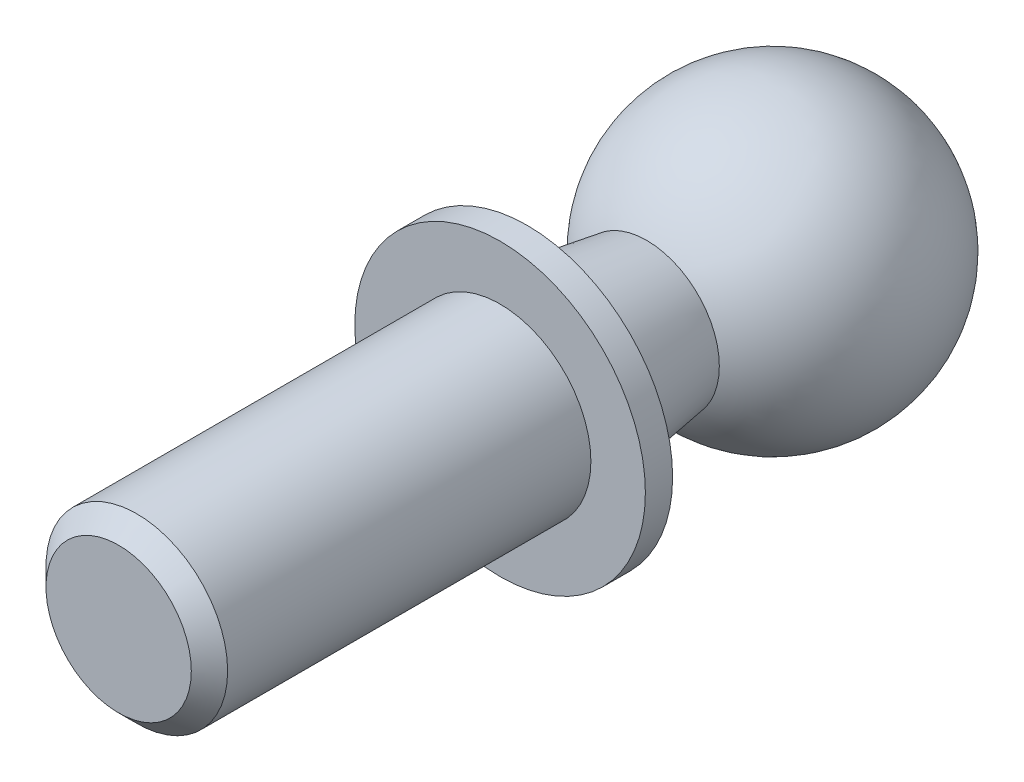
ISO-10303-21;
HEADER;
FILE_DESCRIPTION(('STEP AP214'),'2;1');
FILE_NAME('part.step','',(''),(''),'','','');
FILE_SCHEMA(('AUTOMOTIVE_DESIGN { 1 0 10303 214 1 1 1 1 }'));
ENDSEC;
DATA;
#1=APPLICATION_CONTEXT('core data for automotive mechanical design processes');
#2=APPLICATION_PROTOCOL_DEFINITION('international standard','automotive_design',2000,#1);
#3=PRODUCT_CONTEXT('',#1,'mechanical');
#4=PRODUCT('Part','Part','',(#3));
#5=PRODUCT_RELATED_PRODUCT_CATEGORY('part','',(#4));
#6=PRODUCT_DEFINITION_FORMATION('','',#4);
#7=PRODUCT_DEFINITION_CONTEXT('part definition',#1,'design');
#8=PRODUCT_DEFINITION('design','',#6,#7);
#9=PRODUCT_DEFINITION_SHAPE('','',#8);
#10=(LENGTH_UNIT() NAMED_UNIT(*) SI_UNIT(.MILLI.,.METRE.));
#11=(NAMED_UNIT(*) PLANE_ANGLE_UNIT() SI_UNIT($,.RADIAN.));
#12=(NAMED_UNIT(*) SI_UNIT($,.STERADIAN.) SOLID_ANGLE_UNIT());
#13=UNCERTAINTY_MEASURE_WITH_UNIT(LENGTH_MEASURE(1.E-05),#10,'distance_accuracy_value','');
#14=(GEOMETRIC_REPRESENTATION_CONTEXT(3) GLOBAL_UNCERTAINTY_ASSIGNED_CONTEXT((#13)) GLOBAL_UNIT_ASSIGNED_CONTEXT((#10,
#11,#12)) REPRESENTATION_CONTEXT('',''));
#15=CARTESIAN_POINT('',(0.,0.,0.));
#16=DIRECTION('',(0.,0.,1.));
#17=DIRECTION('',(1.,0.,0.));
#18=AXIS2_PLACEMENT_3D('',#15,#16,#17);
#19=CARTESIAN_POINT('',(0.,0.,0.));
#20=DIRECTION('',(0.,0.,1.));
#21=DIRECTION('',(0.,1.,0.));
#22=AXIS2_PLACEMENT_3D('',#19,#20,#21);
#23=SPHERICAL_SURFACE('',#22,8.);
#24=CARTESIAN_POINT('',(0.,0.,6.92820323027551));
#25=DIRECTION('',(0.,0.,1.));
#26=DIRECTION('',(1.,0.,0.));
#27=AXIS2_PLACEMENT_3D('',#24,#25,#26);
#28=CIRCLE('',#27,4.);
#29=CARTESIAN_POINT('',(4.,0.,6.92820323027551));
#30=VERTEX_POINT('',#29);
#31=EDGE_CURVE('E50',#30,#30,#28,.T.);
#32=ORIENTED_EDGE('',*,*,#31,.F.);
#33=EDGE_LOOP('',(#32));
#34=FACE_BOUND('',#33,.T.);
#35=ADVANCED_FACE('F38',(#34),#23,.T.);
#36=CARTESIAN_POINT('',(0.,0.,13.5));
#37=DIRECTION('',(0.,0.,1.));
#38=DIRECTION('',(1.,0.,0.));
#39=AXIS2_PLACEMENT_3D('',#36,#37,#38);
#40=CONICAL_SURFACE('',#39,5.,0.151007010021336);
#41=ORIENTED_EDGE('',*,*,#31,.T.);
#42=EDGE_LOOP('',(#41));
#43=FACE_BOUND('',#42,.T.);
#44=CARTESIAN_POINT('',(0.,0.,13.5));
#45=DIRECTION('',(0.,0.,1.));
#46=DIRECTION('',(1.,0.,0.));
#47=AXIS2_PLACEMENT_3D('',#44,#45,#46);
#48=CIRCLE('',#47,5.);
#49=CARTESIAN_POINT('',(5.,0.,13.5));
#50=VERTEX_POINT('',#49);
#51=EDGE_CURVE('E54',#50,#50,#48,.T.);
#52=ORIENTED_EDGE('',*,*,#51,.F.);
#53=EDGE_LOOP('',(#52));
#54=FACE_BOUND('',#53,.T.);
#55=ADVANCED_FACE('F86',(#43,#54),#40,.T.);
#56=CARTESIAN_POINT('',(0.,0.,13.5));
#57=DIRECTION('',(0.,0.,1.));
#58=DIRECTION('',(1.,0.,0.));
#59=AXIS2_PLACEMENT_3D('',#56,#57,#58);
#60=PLANE('',#59);
#61=CARTESIAN_POINT('',(0.,0.,13.5));
#62=DIRECTION('',(0.,0.,1.));
#63=DIRECTION('',(1.,0.,0.));
#64=AXIS2_PLACEMENT_3D('',#61,#62,#63);
#65=CIRCLE('',#64,8.);
#66=CARTESIAN_POINT('',(8.,0.,13.5));
#67=VERTEX_POINT('',#66);
#68=EDGE_CURVE('E59',#67,#67,#65,.T.);
#69=ORIENTED_EDGE('',*,*,#68,.F.);
#70=EDGE_LOOP('',(#69));
#71=FACE_BOUND('',#70,.T.);
#72=ORIENTED_EDGE('',*,*,#51,.T.);
#73=EDGE_LOOP('',(#72));
#74=FACE_BOUND('',#73,.T.);
#75=ADVANCED_FACE('F82',(#71,#74),#60,.F.);
#76=CARTESIAN_POINT('',(0.,0.,-8.));
#77=DIRECTION('',(0.,0.,1.));
#78=DIRECTION('',(1.,0.,0.));
#79=AXIS2_PLACEMENT_3D('',#76,#77,#78);
#80=CYLINDRICAL_SURFACE('',#79,8.);
#81=ORIENTED_EDGE('',*,*,#68,.T.);
#82=EDGE_LOOP('',(#81));
#83=FACE_BOUND('',#82,.T.);
#84=CARTESIAN_POINT('',(0.,0.,15.));
#85=DIRECTION('',(0.,0.,1.));
#86=DIRECTION('',(1.,0.,0.));
#87=AXIS2_PLACEMENT_3D('',#84,#85,#86);
#88=CIRCLE('',#87,8.);
#89=CARTESIAN_POINT('',(8.,0.,15.));
#90=VERTEX_POINT('',#89);
#91=EDGE_CURVE('E62',#90,#90,#88,.T.);
#92=ORIENTED_EDGE('',*,*,#91,.F.);
#93=EDGE_LOOP('',(#92));
#94=FACE_BOUND('',#93,.T.);
#95=ADVANCED_FACE('F73',(#83,#94),#80,.T.);
#96=CARTESIAN_POINT('',(0.,0.,15.));
#97=DIRECTION('',(0.,0.,1.));
#98=DIRECTION('',(1.,0.,0.));
#99=AXIS2_PLACEMENT_3D('',#96,#97,#98);
#100=PLANE('',#99);
#101=ORIENTED_EDGE('',*,*,#91,.T.);
#102=EDGE_LOOP('',(#101));
#103=FACE_BOUND('',#102,.T.);
#104=CARTESIAN_POINT('',(0.,0.,15.));
#105=DIRECTION('',(0.,0.,1.));
#106=DIRECTION('',(1.,0.,0.));
#107=AXIS2_PLACEMENT_3D('',#104,#105,#106);
#108=CIRCLE('',#107,5.);
#109=CARTESIAN_POINT('',(5.,0.,15.));
#110=VERTEX_POINT('',#109);
#111=EDGE_CURVE('E65',#110,#110,#108,.T.);
#112=ORIENTED_EDGE('',*,*,#111,.F.);
#113=EDGE_LOOP('',(#112));
#114=FACE_BOUND('',#113,.T.);
#115=ADVANCED_FACE('F71',(#103,#114),#100,.T.);
#116=CARTESIAN_POINT('',(0.,0.,-8.));
#117=DIRECTION('',(0.,0.,1.));
#118=DIRECTION('',(1.,0.,0.));
#119=AXIS2_PLACEMENT_3D('',#116,#117,#118);
#120=CYLINDRICAL_SURFACE('',#119,5.);
#121=CARTESIAN_POINT('',(0.,0.,35.));
#122=DIRECTION('',(0.,0.,1.));
#123=DIRECTION('',(1.,0.,0.));
#124=AXIS2_PLACEMENT_3D('',#121,#122,#123);
#125=CIRCLE('',#124,5.);
#126=CARTESIAN_POINT('',(5.,0.,35.));
#127=VERTEX_POINT('',#126);
#128=EDGE_CURVE('E10',#127,#127,#125,.F.);
#129=ORIENTED_EDGE('',*,*,#128,.T.);
#130=EDGE_LOOP('',(#129));
#131=FACE_BOUND('',#130,.T.);
#132=ORIENTED_EDGE('',*,*,#111,.T.);
#133=EDGE_LOOP('',(#132));
#134=FACE_BOUND('',#133,.T.);
#135=ADVANCED_FACE('F69',(#131,#134),#120,.T.);
#136=CARTESIAN_POINT('',(0.,0.,36.));
#137=DIRECTION('',(0.,0.,1.));
#138=DIRECTION('',(1.,0.,0.));
#139=AXIS2_PLACEMENT_3D('',#136,#137,#138);
#140=PLANE('',#139);
#141=CARTESIAN_POINT('',(0.,0.,36.));
#142=DIRECTION('',(0.,0.,1.));
#143=DIRECTION('',(1.,0.,0.));
#144=AXIS2_PLACEMENT_3D('',#141,#142,#143);
#145=CIRCLE('',#144,4.);
#146=CARTESIAN_POINT('',(4.,0.,36.));
#147=VERTEX_POINT('',#146);
#148=EDGE_CURVE('E46',#147,#147,#145,.T.);
#149=ORIENTED_EDGE('',*,*,#148,.T.);
#150=EDGE_LOOP('',(#149));
#151=FACE_BOUND('',#150,.T.);
#152=ADVANCED_FACE('F80',(#151),#140,.T.);
#153=CARTESIAN_POINT('',(0.,0.,36.));
#154=DIRECTION('',(0.,0.,-1.));
#155=DIRECTION('',(-1.,0.,0.));
#156=AXIS2_PLACEMENT_3D('',#153,#154,#155);
#157=CONICAL_SURFACE('',#156,4.,0.785398163397447);
#158=ORIENTED_EDGE('',*,*,#128,.F.);
#159=EDGE_LOOP('',(#158));
#160=FACE_BOUND('',#159,.T.);
#161=ORIENTED_EDGE('',*,*,#148,.F.);
#162=EDGE_LOOP('',(#161));
#163=FACE_BOUND('',#162,.T.);
#164=ADVANCED_FACE('F41',(#160,#163),#157,.T.);
#165=CLOSED_SHELL('',(#35,#55,#75,#95,#115,#135,#152,#164));
#166=MANIFOLD_SOLID_BREP('B2',#165);
#167=ADVANCED_BREP_SHAPE_REPRESENTATION('',(#18,#166),#14);
#168=SHAPE_DEFINITION_REPRESENTATION(#9,#167);
ENDSEC;
END-ISO-10303-21;
